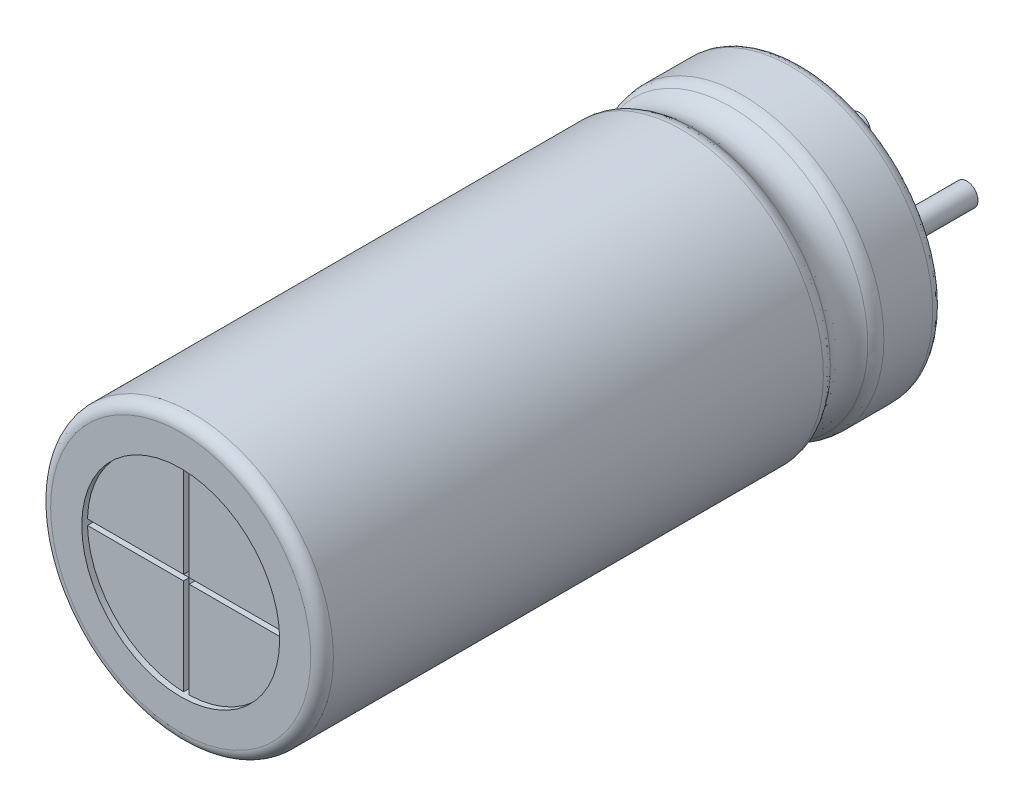
ISO-10303-21;
HEADER;
FILE_DESCRIPTION(('STEP AP214'),'2;1');
FILE_NAME('part.step','',(''),(''),'','','');
FILE_SCHEMA(('AUTOMOTIVE_DESIGN { 1 0 10303 214 1 1 1 1 }'));
ENDSEC;
DATA;
#1=APPLICATION_CONTEXT('core data for automotive mechanical design processes');
#2=APPLICATION_PROTOCOL_DEFINITION('international standard','automotive_design',2000,#1);
#3=PRODUCT_CONTEXT('',#1,'mechanical');
#4=PRODUCT('Part','Part','',(#3));
#5=PRODUCT_RELATED_PRODUCT_CATEGORY('part','',(#4));
#6=PRODUCT_DEFINITION_FORMATION('','',#4);
#7=PRODUCT_DEFINITION_CONTEXT('part definition',#1,'design');
#8=PRODUCT_DEFINITION('design','',#6,#7);
#9=PRODUCT_DEFINITION_SHAPE('','',#8);
#10=(LENGTH_UNIT() NAMED_UNIT(*) SI_UNIT(.MILLI.,.METRE.));
#11=(NAMED_UNIT(*) PLANE_ANGLE_UNIT() SI_UNIT($,.RADIAN.));
#12=(NAMED_UNIT(*) SI_UNIT($,.STERADIAN.) SOLID_ANGLE_UNIT());
#13=UNCERTAINTY_MEASURE_WITH_UNIT(LENGTH_MEASURE(1.E-05),#10,'distance_accuracy_value','');
#14=(GEOMETRIC_REPRESENTATION_CONTEXT(3) GLOBAL_UNCERTAINTY_ASSIGNED_CONTEXT((#13)) GLOBAL_UNIT_ASSIGNED_CONTEXT((#10,
#11,#12)) REPRESENTATION_CONTEXT('',''));
#15=CARTESIAN_POINT('',(0.,0.,0.));
#16=DIRECTION('',(0.,0.,1.));
#17=DIRECTION('',(1.,0.,0.));
#18=AXIS2_PLACEMENT_3D('',#15,#16,#17);
#19=CARTESIAN_POINT('',(2.,0.,-1.9));
#20=DIRECTION('',(0.,0.,1.));
#21=DIRECTION('',(0.,-1.,0.));
#22=AXIS2_PLACEMENT_3D('',#19,#20,#21);
#23=PLANE('',#22);
#24=CARTESIAN_POINT('',(2.,0.,-1.9));
#25=DIRECTION('',(0.,0.,1.));
#26=DIRECTION('',(-1.,0.,0.));
#27=AXIS2_PLACEMENT_3D('',#24,#25,#26);
#28=CIRCLE('',#27,0.2);
#29=CARTESIAN_POINT('',(1.8,0.,-1.9));
#30=VERTEX_POINT('',#29);
#31=EDGE_CURVE('E31',#30,#30,#28,.T.);
#32=ORIENTED_EDGE('',*,*,#31,.F.);
#33=EDGE_LOOP('',(#32));
#34=FACE_BOUND('',#33,.T.);
#35=ADVANCED_FACE('F18',(#34),#23,.F.);
#36=CARTESIAN_POINT('',(2.,0.,0.3));
#37=DIRECTION('',(0.,0.,1.));
#38=DIRECTION('',(-1.,0.,0.));
#39=AXIS2_PLACEMENT_3D('',#36,#37,#38);
#40=CYLINDRICAL_SURFACE('',#39,0.2);
#41=CARTESIAN_POINT('',(2.,0.,0.2));
#42=DIRECTION('',(0.,0.,1.));
#43=DIRECTION('',(-1.,0.,0.));
#44=AXIS2_PLACEMENT_3D('',#41,#42,#43);
#45=CIRCLE('',#44,0.2);
#46=CARTESIAN_POINT('',(1.8,0.,0.2));
#47=VERTEX_POINT('',#46);
#48=EDGE_CURVE('E251',#47,#47,#45,.T.);
#49=ORIENTED_EDGE('',*,*,#48,.F.);
#50=DIRECTION('',(0.,0.,-1.));
#51=VECTOR('',#50,1.);
#52=CARTESIAN_POINT('',(1.8,0.,0.3));
#53=LINE('',#52,#51);
#54=EDGE_CURVE('E11',#47,#30,#53,.T.);
#55=ORIENTED_EDGE('',*,*,#54,.T.);
#56=ORIENTED_EDGE('',*,*,#31,.T.);
#57=ORIENTED_EDGE('',*,*,#54,.F.);
#58=EDGE_LOOP('',(#49,#55,#56,#57));
#59=FACE_BOUND('',#58,.T.);
#60=ADVANCED_FACE('F562',(#59),#40,.T.);
#61=CARTESIAN_POINT('',(1.,0.,0.2));
#62=DIRECTION('',(0.,0.,1.));
#63=DIRECTION('',(1.,0.,0.));
#64=AXIS2_PLACEMENT_3D('',#61,#62,#63);
#65=PLANE('',#64);
#66=CARTESIAN_POINT('',(1.,0.,0.2));
#67=DIRECTION('',(0.,0.,1.));
#68=DIRECTION('',(1.,0.,0.));
#69=AXIS2_PLACEMENT_3D('',#66,#67,#68);
#70=CIRCLE('',#69,1.75);
#71=CARTESIAN_POINT('',(2.75,0.,0.2));
#72=VERTEX_POINT('',#71);
#73=EDGE_CURVE('E240',#72,#72,#70,.T.);
#74=ORIENTED_EDGE('',*,*,#73,.F.);
#75=EDGE_LOOP('',(#74));
#76=FACE_BOUND('',#75,.T.);
#77=ORIENTED_EDGE('',*,*,#48,.T.);
#78=EDGE_LOOP('',(#77));
#79=FACE_BOUND('',#78,.T.);
#80=CARTESIAN_POINT('',(0.,0.,0.2));
#81=DIRECTION('',(0.,0.,1.));
#82=DIRECTION('',(-1.,0.,0.));
#83=AXIS2_PLACEMENT_3D('',#80,#81,#82);
#84=CIRCLE('',#83,0.2);
#85=CARTESIAN_POINT('',(-0.2,0.,0.2));
#86=VERTEX_POINT('',#85);
#87=EDGE_CURVE('E247',#86,#86,#84,.T.);
#88=ORIENTED_EDGE('',*,*,#87,.T.);
#89=EDGE_LOOP('',(#88));
#90=FACE_BOUND('',#89,.T.);
#91=ADVANCED_FACE('F565',(#76,#79,#90),#65,.F.);
#92=CARTESIAN_POINT('',(1.,0.,0.3));
#93=DIRECTION('',(0.,0.,-1.));
#94=DIRECTION('',(1.,0.,0.));
#95=AXIS2_PLACEMENT_3D('',#92,#93,#94);
#96=CYLINDRICAL_SURFACE('',#95,1.75);
#97=DIRECTION('',(0.,0.,-1.));
#98=VECTOR('',#97,1.);
#99=CARTESIAN_POINT('',(2.75,0.,0.3));
#100=LINE('',#99,#98);
#101=CARTESIAN_POINT('',(2.75,0.,0.));
#102=VERTEX_POINT('',#101);
#103=EDGE_CURVE('E252',#72,#102,#100,.T.);
#104=ORIENTED_EDGE('',*,*,#103,.T.);
#105=CARTESIAN_POINT('',(1.,0.,0.));
#106=DIRECTION('',(0.,0.,-1.));
#107=DIRECTION('',(1.,0.,0.));
#108=AXIS2_PLACEMENT_3D('',#105,#106,#107);
#109=CIRCLE('',#108,1.75);
#110=EDGE_CURVE('E262',#102,#102,#109,.T.);
#111=ORIENTED_EDGE('',*,*,#110,.T.);
#112=ORIENTED_EDGE('',*,*,#103,.F.);
#113=ORIENTED_EDGE('',*,*,#73,.T.);
#114=EDGE_LOOP('',(#104,#111,#112,#113));
#115=FACE_BOUND('',#114,.T.);
#116=ADVANCED_FACE('F569',(#115),#96,.F.);
#117=CARTESIAN_POINT('',(0.,0.,0.3));
#118=DIRECTION('',(0.,0.,1.));
#119=DIRECTION('',(-1.,0.,0.));
#120=AXIS2_PLACEMENT_3D('',#117,#118,#119);
#121=CYLINDRICAL_SURFACE('',#120,0.2);
#122=ORIENTED_EDGE('',*,*,#87,.F.);
#123=DIRECTION('',(0.,0.,-1.));
#124=VECTOR('',#123,1.);
#125=CARTESIAN_POINT('',(-0.2,0.,0.3));
#126=LINE('',#125,#124);
#127=CARTESIAN_POINT('',(-0.2,0.,-2.));
#128=VERTEX_POINT('',#127);
#129=EDGE_CURVE('E283',#86,#128,#126,.T.);
#130=ORIENTED_EDGE('',*,*,#129,.T.);
#131=CARTESIAN_POINT('',(0.,0.,-2.));
#132=DIRECTION('',(0.,0.,1.));
#133=DIRECTION('',(-1.,0.,0.));
#134=AXIS2_PLACEMENT_3D('',#131,#132,#133);
#135=CIRCLE('',#134,0.2);
#136=EDGE_CURVE('E287',#128,#128,#135,.T.);
#137=ORIENTED_EDGE('',*,*,#136,.T.);
#138=ORIENTED_EDGE('',*,*,#129,.F.);
#139=EDGE_LOOP('',(#122,#130,#137,#138));
#140=FACE_BOUND('',#139,.T.);
#141=ADVANCED_FACE('F573',(#140),#121,.T.);
#142=CARTESIAN_POINT('',(1.,0.,0.));
#143=DIRECTION('',(0.,0.,-1.));
#144=DIRECTION('',(0.,-1.,0.));
#145=AXIS2_PLACEMENT_3D('',#142,#143,#144);
#146=PLANE('',#145);
#147=ORIENTED_EDGE('',*,*,#110,.F.);
#148=EDGE_LOOP('',(#147));
#149=FACE_BOUND('',#148,.T.);
#150=CARTESIAN_POINT('',(1.,0.,0.));
#151=DIRECTION('',(0.,0.,-1.));
#152=DIRECTION('',(1.,0.,0.));
#153=AXIS2_PLACEMENT_3D('',#150,#151,#152);
#154=CIRCLE('',#153,2.3);
#155=CARTESIAN_POINT('',(3.3,0.,0.));
#156=VERTEX_POINT('',#155);
#157=EDGE_CURVE('E288',#156,#156,#154,.T.);
#158=ORIENTED_EDGE('',*,*,#157,.T.);
#159=EDGE_LOOP('',(#158));
#160=FACE_BOUND('',#159,.T.);
#161=ADVANCED_FACE('F577',(#149,#160),#146,.T.);
#162=CARTESIAN_POINT('',(0.,0.,-2.));
#163=DIRECTION('',(0.,0.,1.));
#164=DIRECTION('',(1.,0.,0.));
#165=AXIS2_PLACEMENT_3D('',#162,#163,#164);
#166=PLANE('',#165);
#167=ORIENTED_EDGE('',*,*,#136,.F.);
#168=EDGE_LOOP('',(#167));
#169=FACE_BOUND('',#168,.T.);
#170=ADVANCED_FACE('F437',(#169),#166,.F.);
#171=CARTESIAN_POINT('',(3.3,0.,0.));
#172=CARTESIAN_POINT('',(3.41715728752538,0.,0.));
#173=CARTESIAN_POINT('',(3.5,0.,0.0828427124746191));
#174=CARTESIAN_POINT('',(3.5,0.,0.2));
#175=(BOUNDED_CURVE() B_SPLINE_CURVE(3,(#171,#172,#173,#174),.UNSPECIFIED.,.F.,
.F.) B_SPLINE_CURVE_WITH_KNOTS((4,4),(0.,1.),
.UNSPECIFIED.) CURVE() GEOMETRIC_REPRESENTATION_ITEM() RATIONAL_B_SPLINE_CURVE((1.,
0.804737854124365,0.804737854124365,1.)) REPRESENTATION_ITEM(''));
#176=CARTESIAN_POINT('',(1.,0.,0.));
#177=DIRECTION('',(0.,0.,1.));
#178=AXIS1_PLACEMENT('',#176,#177);
#179=SURFACE_OF_REVOLUTION('',#175,#178);
#180=CARTESIAN_POINT('',(3.3,0.,0.2));
#181=DIRECTION('',(0.,-1.,0.));
#182=DIRECTION('',(0.,0.,-1.));
#183=AXIS2_PLACEMENT_3D('',#180,#181,#182);
#184=CIRCLE('',#183,0.2);
#185=CARTESIAN_POINT('',(3.5,0.,0.2));
#186=VERTEX_POINT('',#185);
#187=EDGE_CURVE('E257',#156,#186,#184,.T.);
#188=ORIENTED_EDGE('',*,*,#187,.T.);
#189=CARTESIAN_POINT('',(1.,0.,0.2));
#190=DIRECTION('',(0.,0.,-1.));
#191=DIRECTION('',(1.,0.,0.));
#192=AXIS2_PLACEMENT_3D('',#189,#190,#191);
#193=CIRCLE('',#192,2.5);
#194=EDGE_CURVE('E253',#186,#186,#193,.T.);
#195=ORIENTED_EDGE('',*,*,#194,.T.);
#196=ORIENTED_EDGE('',*,*,#187,.F.);
#197=ORIENTED_EDGE('',*,*,#157,.F.);
#198=EDGE_LOOP('',(#188,#195,#196,#197));
#199=FACE_BOUND('',#198,.T.);
#200=ADVANCED_FACE('F433',(#199),#179,.T.);
#201=CARTESIAN_POINT('',(1.,0.,0.2));
#202=DIRECTION('',(0.,0.,1.));
#203=DIRECTION('',(1.,0.,0.));
#204=AXIS2_PLACEMENT_3D('',#201,#202,#203);
#205=CYLINDRICAL_SURFACE('',#204,2.5);
#206=CARTESIAN_POINT('',(3.5,0.,1.064979142851));
#207=CARTESIAN_POINT('',(3.499999999999,1.190825886764,1.064979142851));
#208=CARTESIAN_POINT('',(2.884541892305,2.409113115874,1.064979142851));
#209=CARTESIAN_POINT('',(1.618015285806,3.28024032087,1.064979142851));
#210=CARTESIAN_POINT('',(-0.124886085383,3.414028857892,1.064979142852));
#211=CARTESIAN_POINT('',(-1.630545419379,2.485545151003,1.064979142851));
#212=CARTESIAN_POINT('',(-2.734788378774,1.130166370723,1.064979142852));
#213=CARTESIAN_POINT('',(-2.734788378755,-1.130166370699,1.06497914285));
#214=CARTESIAN_POINT('',(-1.630545419375,-2.485545151045,1.064979142852));
#215=CARTESIAN_POINT('',(-0.124886085402,-3.414028857855,1.064979142851));
#216=CARTESIAN_POINT('',(1.618015285825,-3.280240320887,1.064979142851));
#217=CARTESIAN_POINT('',(2.884541892296,-2.409113115869,1.064979142851));
#218=CARTESIAN_POINT('',(3.500000000001,-1.190825886764,1.064979142851));
#219=CARTESIAN_POINT('',(3.5,0.,1.064979142851));
#220=(BOUNDED_CURVE() B_SPLINE_CURVE(13,(#206,#207,#208,#209,#210,#211,#212,#213,#214,#215,#216,
#217,#218,#219),.UNSPECIFIED.,.T.,.F.) B_SPLINE_CURVE_WITH_KNOTS((14,14),(0.,15.707963267949),
.UNSPECIFIED.) CURVE() GEOMETRIC_REPRESENTATION_ITEM() RATIONAL_B_SPLINE_CURVE((1.,1.,
0.999999999999,1.000000000002,0.999999999995,1.000000000008,0.99999999999,1.000000000011,
0.99999999999,1.000000000006,0.999999999997,1.000000000001,1.,1.)) REPRESENTATION_ITEM(''));
#221=CARTESIAN_POINT('',(3.5,0.,1.064979142851));
#222=VERTEX_POINT('',#221);
#223=EDGE_CURVE('E258',#222,#222,#220,.F.);
#224=ORIENTED_EDGE('',*,*,#223,.T.);
#225=DIRECTION('',(0.,0.,1.));
#226=VECTOR('',#225,1.);
#227=CARTESIAN_POINT('',(3.5,0.,0.2));
#228=LINE('',#227,#226);
#229=EDGE_CURVE('E605',#186,#222,#228,.T.);
#230=ORIENTED_EDGE('',*,*,#229,.F.);
#231=ORIENTED_EDGE('',*,*,#194,.F.);
#232=ORIENTED_EDGE('',*,*,#229,.T.);
#233=EDGE_LOOP('',(#224,#230,#231,#232));
#234=FACE_BOUND('',#233,.T.);
#235=ADVANCED_FACE('F436',(#234),#205,.T.);
#236=CARTESIAN_POINT('',(3.5,0.,1.064979142851));
#237=CARTESIAN_POINT('',(3.500000000001,-1.190825886764,1.064979142851));
#238=CARTESIAN_POINT('',(2.884541892296,-2.409113115869,1.064979142851));
#239=CARTESIAN_POINT('',(1.618015285825,-3.280240320887,1.064979142851));
#240=CARTESIAN_POINT('',(-0.124886085402,-3.414028857855,1.064979142851));
#241=CARTESIAN_POINT('',(-1.630545419375,-2.485545151045,1.064979142852));
#242=CARTESIAN_POINT('',(-2.734788378755,-1.130166370699,1.06497914285));
#243=CARTESIAN_POINT('',(-2.734788378774,1.130166370723,1.064979142852));
#244=CARTESIAN_POINT('',(-1.630545419379,2.485545151003,1.064979142851));
#245=CARTESIAN_POINT('',(-0.124886085383,3.414028857892,1.064979142852));
#246=CARTESIAN_POINT('',(1.618015285806,3.28024032087,1.064979142851));
#247=CARTESIAN_POINT('',(2.884541892305,2.409113115874,1.064979142851));
#248=CARTESIAN_POINT('',(3.499999999999,1.190825886764,1.064979142851));
#249=CARTESIAN_POINT('',(3.5,0.,1.064979142851));
#250=CARTESIAN_POINT('',(3.5,0.,1.182962690499));
#251=CARTESIAN_POINT('',(3.500000000001,-1.190825886764,1.182962690499));
#252=CARTESIAN_POINT('',(2.884541892297,-2.40911311587,1.182962690499));
#253=CARTESIAN_POINT('',(1.618015285824,-3.280240320884,1.182962690499));
#254=CARTESIAN_POINT('',(-0.1248860854,-3.414028857861,1.182962690499));
#255=CARTESIAN_POINT('',(-1.630545419378,-2.485545151035,1.182962690499));
#256=CARTESIAN_POINT('',(-2.73478837875,-1.13016637071,1.182962690499));
#257=CARTESIAN_POINT('',(-2.73478837878,1.130166370735,1.182962690499));
#258=CARTESIAN_POINT('',(-1.630545419374,2.485545150991,1.182962690499));
#259=CARTESIAN_POINT('',(-0.124886085386,3.414028857901,1.182962690499));
#260=CARTESIAN_POINT('',(1.618015285807,3.280240320865,1.182962690499));
#261=CARTESIAN_POINT('',(2.884541892305,2.409113115875,1.182962690499));
#262=CARTESIAN_POINT('',(3.499999999999,1.190825886764,1.182962690499));
#263=CARTESIAN_POINT('',(3.5,0.,1.182962690499));
#264=CARTESIAN_POINT('',(3.419629897377,0.,1.269338405373));
#265=CARTESIAN_POINT('',(3.419629897378,-1.152543167274,1.269338405373));
#266=CARTESIAN_POINT('',(2.823957562183,-2.331664848528,1.269338405373));
#267=CARTESIAN_POINT('',(1.598147305047,-3.174787020397,1.269338405373));
#268=CARTESIAN_POINT('',(-0.08872320135259,-3.304274517993,1.269338405373));
#269=CARTESIAN_POINT('',(-1.545978537251,-2.405639743493,1.269338405373));
#270=CARTESIAN_POINT('',(-2.614722248644,-1.093833735828,1.269338405373));
#271=CARTESIAN_POINT('',(-2.614722248662,1.093833735852,1.269338405373));
#272=CARTESIAN_POINT('',(-1.545978537255,2.405639743452,1.269338405373));
#273=CARTESIAN_POINT('',(-0.08872320133354,3.304274518029,1.269338405373));
#274=CARTESIAN_POINT('',(1.598147305028,3.17478702038,1.269338405373));
#275=CARTESIAN_POINT('',(2.823957562192,2.331664848533,1.269338405373));
#276=CARTESIAN_POINT('',(3.419629897376,1.152543167273,1.269338405373));
#277=CARTESIAN_POINT('',(3.419629897377,0.,1.269338405373));
#278=(BOUNDED_SURFACE() B_SPLINE_SURFACE(2,13,((#236,#237,#238,#239,#240,#241,#242,#243,#244,
#245,#246,#247,#248,#249),(#250,#251,#252,#253,#254,#255,#256,#257,#258,#259,#260,#261,#262,
#263),(#264,#265,#266,#267,#268,#269,#270,#271,#272,#273,#274,#275,#276,#277)),.UNSPECIFIED.,
.F.,.T.,.F.) B_SPLINE_SURFACE_WITH_KNOTS((3,3),(14,14),(0.,15.707963267949),(0.,
15.707963267949),.UNSPECIFIED.) GEOMETRIC_REPRESENTATION_ITEM() RATIONAL_B_SPLINE_SURFACE(((1.,
1.,1.000000000001,0.999999999997,1.000000000006,0.99999999999,1.000000000011,0.99999999999,
1.000000000008,0.999999999995,1.000000000002,0.999999999999,1.,1.),(0.93061798229,
0.930617982289,0.930617982291,0.930617982287,0.930617982296,0.930617982281,0.9306179823,
0.93061798228,0.930617982297,0.930617982285,0.930617982292,0.930617982289,0.93061798229,
0.93061798229),(1.,1.,1.000000000001,0.999999999997,1.000000000006,0.99999999999,1.000000000011,
0.99999999999,1.000000000008,0.999999999995,1.000000000002,0.999999999999,1.,1.))) REPRESENTATION_ITEM('') SURFACE());
#279=CARTESIAN_POINT('',(3.5,0.,1.064979142851));
#280=CARTESIAN_POINT('',(3.5,0.,1.182962690499));
#281=CARTESIAN_POINT('',(3.419629897377,0.,1.269338405373));
#282=(BOUNDED_CURVE() B_SPLINE_CURVE(2,(#279,#280,#281),.UNSPECIFIED.,.F.,
.F.) B_SPLINE_CURVE_WITH_KNOTS((3,3),(0.,15.707963267949),
.UNSPECIFIED.) CURVE() GEOMETRIC_REPRESENTATION_ITEM() RATIONAL_B_SPLINE_CURVE((1.,
0.93061798229,1.)) REPRESENTATION_ITEM(''));
#283=CARTESIAN_POINT('',(3.419629897377,0.,1.269338405373));
#284=VERTEX_POINT('',#283);
#285=EDGE_CURVE('E613',#222,#284,#282,.T.);
#286=CARTESIAN_POINT('',(3.41962989737711,0.,1.26933840537289));
#287=CARTESIAN_POINT('',(3.41962989737811,-1.15254316727405,1.26933840537289));
#288=CARTESIAN_POINT('',(2.82395756218308,-2.3316648485281,1.26933840537289));
#289=CARTESIAN_POINT('',(1.59814730504703,-3.17478702039714,1.26933840537289));
#290=CARTESIAN_POINT('',(-0.088723201352638,-3.30427451799315,1.26933840537289));
#291=CARTESIAN_POINT('',(-1.54597853725111,-2.40563974349311,1.26933840537288));
#292=CARTESIAN_POINT('',(-2.61472224864416,-1.09383373582805,1.26933840537288));
#293=CARTESIAN_POINT('',(-2.61472224866216,1.09383373585205,1.26933840537288));
#294=CARTESIAN_POINT('',(-1.54597853725511,2.40563974345211,1.26933840537288));
#295=CARTESIAN_POINT('',(-0.088723201333588,3.30427451802915,1.26933840537288));
#296=CARTESIAN_POINT('',(1.59814730502803,3.17478702038014,1.26933840537289));
#297=CARTESIAN_POINT('',(2.82395756219208,2.33166484853311,1.26933840537288));
#298=CARTESIAN_POINT('',(3.41962989737611,1.15254316727305,1.26933840537289));
#299=CARTESIAN_POINT('',(3.41962989737711,0.,1.26933840537289));
#300=(BOUNDED_CURVE() B_SPLINE_CURVE(13,(#286,#287,#288,#289,#290,#291,#292,#293,#294,#295,#296,
#297,#298,#299),.UNSPECIFIED.,.T.,.F.) B_SPLINE_CURVE_WITH_KNOTS((14,14),(0.,15.707963267949),
.UNSPECIFIED.) CURVE() GEOMETRIC_REPRESENTATION_ITEM() RATIONAL_B_SPLINE_CURVE((0.999999999999901,
0.999999999999901,1.0000000000009,0.999999999996901,1.0000000000059,0.999999999989901,
1.0000000000109,0.999999999989901,1.0000000000079,0.999999999994901,1.0000000000019,
0.999999999998901,0.999999999999901,0.999999999999901)) REPRESENTATION_ITEM(''));
#301=EDGE_CURVE('E618',#284,#284,#300,.T.);
#302=ORIENTED_EDGE('',*,*,#285,.T.);
#303=ORIENTED_EDGE('',*,*,#301,.T.);
#304=ORIENTED_EDGE('',*,*,#285,.F.);
#305=ORIENTED_EDGE('',*,*,#223,.F.);
#306=EDGE_LOOP('',(#302,#303,#304,#305));
#307=FACE_BOUND('',#306,.T.);
#308=ADVANCED_FACE('F514',(#307),#278,.T.);
#309=CARTESIAN_POINT('',(3.42262261853665,0.,1.26615096071228));
#310=CARTESIAN_POINT('',(3.23532926410463,0.,1.46383893950967));
#311=CARTESIAN_POINT('',(3.23532926410463,0.,1.73616106049032));
#312=CARTESIAN_POINT('',(3.42262261853665,0.,1.93384903928772));
#313=(BOUNDED_CURVE() B_SPLINE_CURVE(3,(#309,#310,#311,#312),.UNSPECIFIED.,.F.,
.F.) B_SPLINE_CURVE_WITH_KNOTS((4,4),(0.,1.),
.UNSPECIFIED.) CURVE() GEOMETRIC_REPRESENTATION_ITEM() RATIONAL_B_SPLINE_CURVE((1.,
0.817289559108677,0.817289559108677,1.)) REPRESENTATION_ITEM(''));
#314=CARTESIAN_POINT('',(1.,0.,0.));
#315=DIRECTION('',(0.,0.,1.));
#316=AXIS1_PLACEMENT('',#314,#315);
#317=SURFACE_OF_REVOLUTION('',#313,#316);
#318=CARTESIAN_POINT('',(1.,0.,1.93066159462752));
#319=DIRECTION('',(0.,0.,-1.));
#320=DIRECTION('',(1.,0.,0.));
#321=AXIS2_PLACEMENT_3D('',#318,#319,#320);
#322=CIRCLE('',#321,2.41962989737643);
#323=CARTESIAN_POINT('',(3.419629897377,0.,1.930661594627));
#324=VERTEX_POINT('',#323);
#325=EDGE_CURVE('E650',#324,#324,#322,.T.);
#326=ORIENTED_EDGE('',*,*,#325,.T.);
#327=CARTESIAN_POINT('',(3.775,0.,1.6));
#328=DIRECTION('',(0.,1.,0.));
#329=DIRECTION('',(-0.566528822887193,0.,-0.82404192419928));
#330=AXIS2_PLACEMENT_3D('',#327,#328,#329);
#331=CIRCLE('',#330,0.485412195974);
#332=EDGE_CURVE('E642',#284,#324,#331,.T.);
#333=ORIENTED_EDGE('',*,*,#332,.F.);
#334=ORIENTED_EDGE('',*,*,#301,.F.);
#335=ORIENTED_EDGE('',*,*,#332,.T.);
#336=EDGE_LOOP('',(#326,#333,#334,#335));
#337=FACE_BOUND('',#336,.T.);
#338=ADVANCED_FACE('F20',(#337),#317,.T.);
#339=CARTESIAN_POINT('',(3.419629897377,0.,1.930661594627));
#340=CARTESIAN_POINT('',(3.419629897378,-1.152543167274,1.930661594627));
#341=CARTESIAN_POINT('',(2.823957562183,-2.331664848528,1.930661594627));
#342=CARTESIAN_POINT('',(1.598147305047,-3.174787020397,1.930661594627));
#343=CARTESIAN_POINT('',(-0.0887232013526299,-3.304274517993,1.930661594627));
#344=CARTESIAN_POINT('',(-1.545978537251,-2.405639743492,1.930661594627));
#345=CARTESIAN_POINT('',(-2.614722248643,-1.093833735829,1.930661594627));
#346=CARTESIAN_POINT('',(-2.614722248663,1.093833735853,1.930661594627));
#347=CARTESIAN_POINT('',(-1.545978537254,2.405639743451,1.930661594627));
#348=CARTESIAN_POINT('',(-0.0887232013347,3.30427451803,1.930661594627));
#349=CARTESIAN_POINT('',(1.598147305029,3.17478702038,1.930661594627));
#350=CARTESIAN_POINT('',(2.823957562192,2.331664848533,1.930661594627));
#351=CARTESIAN_POINT('',(3.419629897376,1.152543167273,1.930661594627));
#352=CARTESIAN_POINT('',(3.419629897377,0.,1.930661594627));
#353=CARTESIAN_POINT('',(3.5,0.,2.017037309501));
#354=CARTESIAN_POINT('',(3.500000000001,-1.190825886764,2.017037309501));
#355=CARTESIAN_POINT('',(2.884541892296,-2.40911311587,2.017037309501));
#356=CARTESIAN_POINT('',(1.618015285824,-3.280240320885,2.017037309501));
#357=CARTESIAN_POINT('',(-0.124886085397,-3.414028857858,2.017037309501));
#358=CARTESIAN_POINT('',(-1.630545419388,-2.485545151038,2.0170373095));
#359=CARTESIAN_POINT('',(-2.734788378733,-1.130166370711,2.017037309501));
#360=CARTESIAN_POINT('',(-2.734788378798,1.130166370745,2.0170373095));
#361=CARTESIAN_POINT('',(-1.630545419362,2.485545150978,2.017037309501));
#362=CARTESIAN_POINT('',(-0.124886085391,3.414028857911,2.017037309501));
#363=CARTESIAN_POINT('',(1.618015285808,3.28024032086,2.017037309501));
#364=CARTESIAN_POINT('',(2.884541892305,2.409113115877,2.017037309501));
#365=CARTESIAN_POINT('',(3.499999999999,1.190825886763,2.017037309501));
#366=CARTESIAN_POINT('',(3.5,0.,2.017037309501));
#367=CARTESIAN_POINT('',(3.5,0.,2.135020857149));
#368=CARTESIAN_POINT('',(3.500000000002,-1.190825886764,2.135020857149));
#369=CARTESIAN_POINT('',(2.884541892295,-2.409113115869,2.135020857149));
#370=CARTESIAN_POINT('',(1.618015285826,-3.280240320886,2.135020857149));
#371=CARTESIAN_POINT('',(-0.124886085405,-3.414028857857,2.135020857149));
#372=CARTESIAN_POINT('',(-1.630545419372,-2.485545151043,2.135020857149));
#373=CARTESIAN_POINT('',(-2.734788378759,-1.130166370701,2.135020857149));
#374=CARTESIAN_POINT('',(-2.73478837877,1.130166370726,2.135020857149));
#375=CARTESIAN_POINT('',(-1.630545419382,2.485545151,2.135020857149));
#376=CARTESIAN_POINT('',(-0.124886085381,3.414028857894,2.135020857149));
#377=CARTESIAN_POINT('',(1.618015285805,3.280240320869,2.135020857149));
#378=CARTESIAN_POINT('',(2.884541892306,2.409113115874,2.135020857149));
#379=CARTESIAN_POINT('',(3.499999999999,1.190825886764,2.135020857149));
#380=CARTESIAN_POINT('',(3.5,0.,2.135020857149));
#381=(BOUNDED_SURFACE() B_SPLINE_SURFACE(2,13,((#339,#340,#341,#342,#343,#344,#345,#346,#347,
#348,#349,#350,#351,#352),(#353,#354,#355,#356,#357,#358,#359,#360,#361,#362,#363,#364,#365,
#366),(#367,#368,#369,#370,#371,#372,#373,#374,#375,#376,#377,#378,#379,#380)),.UNSPECIFIED.,
.F.,.T.,.F.) B_SPLINE_SURFACE_WITH_KNOTS((3,3),(14,14),(0.,15.707963267949),(0.,
15.707963267949),.UNSPECIFIED.) GEOMETRIC_REPRESENTATION_ITEM() RATIONAL_B_SPLINE_SURFACE(((1.,
1.,1.000000000001,0.999999999997,1.000000000006,0.99999999999,1.000000000011,0.99999999999,
1.000000000008,0.999999999995,1.000000000002,0.999999999999,1.,1.),(0.93061798229,
0.930617982289,0.930617982291,0.930617982286,0.930617982297,0.930617982278,0.930617982304,
0.930617982276,0.9306179823,0.930617982283,0.930617982293,0.930617982288,0.93061798229,
0.93061798229),(1.,1.,1.000000000001,0.999999999997,1.000000000006,0.99999999999,1.000000000011,
0.99999999999,1.000000000008,0.999999999995,1.000000000002,0.999999999999,1.,1.))) REPRESENTATION_ITEM('') SURFACE());
#382=CARTESIAN_POINT('',(3.419629897377,0.,1.930661594627));
#383=CARTESIAN_POINT('',(3.5,0.,2.017037309501));
#384=CARTESIAN_POINT('',(3.5,0.,2.135020857149));
#385=(BOUNDED_CURVE() B_SPLINE_CURVE(2,(#382,#383,#384),.UNSPECIFIED.,.F.,
.F.) B_SPLINE_CURVE_WITH_KNOTS((3,3),(0.,15.707963267949),
.UNSPECIFIED.) CURVE() GEOMETRIC_REPRESENTATION_ITEM() RATIONAL_B_SPLINE_CURVE((1.,
0.93061798229,1.)) REPRESENTATION_ITEM(''));
#386=CARTESIAN_POINT('',(3.5,0.,2.135020857149));
#387=VERTEX_POINT('',#386);
#388=EDGE_CURVE('E651',#324,#387,#385,.T.);
#389=CARTESIAN_POINT('',(3.5,0.,2.135020857149));
#390=CARTESIAN_POINT('',(3.500000000002,-1.190825886764,2.135020857149));
#391=CARTESIAN_POINT('',(2.884541892295,-2.409113115869,2.135020857149));
#392=CARTESIAN_POINT('',(1.618015285826,-3.280240320886,2.135020857149));
#393=CARTESIAN_POINT('',(-0.124886085405,-3.414028857857,2.135020857149));
#394=CARTESIAN_POINT('',(-1.630545419372,-2.485545151043,2.135020857149));
#395=CARTESIAN_POINT('',(-2.734788378759,-1.130166370701,2.135020857149));
#396=CARTESIAN_POINT('',(-2.73478837877,1.130166370726,2.135020857149));
#397=CARTESIAN_POINT('',(-1.630545419382,2.485545151,2.135020857149));
#398=CARTESIAN_POINT('',(-0.124886085381,3.414028857894,2.135020857149));
#399=CARTESIAN_POINT('',(1.618015285805,3.280240320869,2.135020857149));
#400=CARTESIAN_POINT('',(2.884541892306,2.409113115874,2.135020857149));
#401=CARTESIAN_POINT('',(3.499999999999,1.190825886764,2.135020857149));
#402=CARTESIAN_POINT('',(3.5,0.,2.135020857149));
#403=(BOUNDED_CURVE() B_SPLINE_CURVE(13,(#389,#390,#391,#392,#393,#394,#395,#396,#397,#398,#399,
#400,#401,#402),.UNSPECIFIED.,.T.,.F.) B_SPLINE_CURVE_WITH_KNOTS((14,14),(0.,15.707963267949),
.UNSPECIFIED.) CURVE() GEOMETRIC_REPRESENTATION_ITEM() RATIONAL_B_SPLINE_CURVE((1.,1.,
1.000000000001,0.999999999997,1.000000000006,0.99999999999,1.000000000011,0.99999999999,
1.000000000008,0.999999999995,1.000000000002,0.999999999999,1.,1.)) REPRESENTATION_ITEM(''));
#404=EDGE_CURVE('E267',#387,#387,#403,.T.);
#405=ORIENTED_EDGE('',*,*,#388,.T.);
#406=ORIENTED_EDGE('',*,*,#404,.T.);
#407=ORIENTED_EDGE('',*,*,#388,.F.);
#408=ORIENTED_EDGE('',*,*,#325,.F.);
#409=EDGE_LOOP('',(#405,#406,#407,#408));
#410=FACE_BOUND('',#409,.T.);
#411=ADVANCED_FACE('F506',(#410),#381,.T.);
#412=CARTESIAN_POINT('',(1.,0.,2.));
#413=DIRECTION('',(0.,0.,1.));
#414=DIRECTION('',(1.,0.,0.));
#415=AXIS2_PLACEMENT_3D('',#412,#413,#414);
#416=CYLINDRICAL_SURFACE('',#415,2.5);
#417=CARTESIAN_POINT('',(1.,0.,10.8));
#418=DIRECTION('',(0.,0.,-1.));
#419=DIRECTION('',(1.,0.,0.));
#420=AXIS2_PLACEMENT_3D('',#417,#418,#419);
#421=CIRCLE('',#420,2.5);
#422=CARTESIAN_POINT('',(3.5,0.,10.8));
#423=VERTEX_POINT('',#422);
#424=EDGE_CURVE('E263',#423,#423,#421,.T.);
#425=ORIENTED_EDGE('',*,*,#424,.T.);
#426=DIRECTION('',(0.,0.,1.));
#427=VECTOR('',#426,1.);
#428=CARTESIAN_POINT('',(3.5,0.,2.));
#429=LINE('',#428,#427);
#430=EDGE_CURVE('E268',#387,#423,#429,.T.);
#431=ORIENTED_EDGE('',*,*,#430,.F.);
#432=ORIENTED_EDGE('',*,*,#404,.F.);
#433=ORIENTED_EDGE('',*,*,#430,.T.);
#434=EDGE_LOOP('',(#425,#431,#432,#433));
#435=FACE_BOUND('',#434,.T.);
#436=ADVANCED_FACE('F512',(#435),#416,.T.);
#437=CARTESIAN_POINT('',(1.,0.,10.8));
#438=DIRECTION('',(0.,0.,1.));
#439=DIRECTION('',(1.,0.,0.));
#440=AXIS2_PLACEMENT_3D('',#437,#438,#439);
#441=TOROIDAL_SURFACE('',#440,2.3,0.2);
#442=CARTESIAN_POINT('',(3.3,0.,10.8));
#443=DIRECTION('',(0.,-1.,0.));
#444=DIRECTION('',(1.,0.,0.));
#445=AXIS2_PLACEMENT_3D('',#442,#443,#444);
#446=CIRCLE('',#445,0.2);
#447=CARTESIAN_POINT('',(3.3,0.,11.));
#448=VERTEX_POINT('',#447);
#449=EDGE_CURVE('E245',#423,#448,#446,.T.);
#450=ORIENTED_EDGE('',*,*,#449,.T.);
#451=CARTESIAN_POINT('',(1.,0.,11.));
#452=DIRECTION('',(0.,0.,-1.));
#453=DIRECTION('',(1.,0.,0.));
#454=AXIS2_PLACEMENT_3D('',#451,#452,#453);
#455=CIRCLE('',#454,2.3);
#456=EDGE_CURVE('E242',#448,#448,#455,.T.);
#457=ORIENTED_EDGE('',*,*,#456,.T.);
#458=ORIENTED_EDGE('',*,*,#449,.F.);
#459=ORIENTED_EDGE('',*,*,#424,.F.);
#460=EDGE_LOOP('',(#450,#457,#458,#459));
#461=FACE_BOUND('',#460,.T.);
#462=ADVANCED_FACE('F504',(#461),#441,.T.);
#463=CARTESIAN_POINT('',(1.,0.,11.));
#464=DIRECTION('',(0.,0.,-1.));
#465=DIRECTION('',(0.,-1.,0.));
#466=AXIS2_PLACEMENT_3D('',#463,#464,#465);
#467=PLANE('',#466);
#468=ORIENTED_EDGE('',*,*,#456,.F.);
#469=EDGE_LOOP('',(#468));
#470=FACE_BOUND('',#469,.T.);
#471=CARTESIAN_POINT('',(1.,0.,11.));
#472=DIRECTION('',(0.,0.,-1.));
#473=DIRECTION('',(1.,0.,0.));
#474=AXIS2_PLACEMENT_3D('',#471,#472,#473);
#475=CIRCLE('',#474,1.75);
#476=CARTESIAN_POINT('',(2.75,0.,11.));
#477=VERTEX_POINT('',#476);
#478=EDGE_CURVE('E246',#477,#477,#475,.T.);
#479=ORIENTED_EDGE('',*,*,#478,.T.);
#480=EDGE_LOOP('',(#479));
#481=FACE_BOUND('',#480,.T.);
#482=ADVANCED_FACE('F500',(#470,#481),#467,.F.);
#483=CARTESIAN_POINT('',(1.,0.,11.));
#484=DIRECTION('',(0.,0.,-1.));
#485=DIRECTION('',(1.,0.,0.));
#486=AXIS2_PLACEMENT_3D('',#483,#484,#485);
#487=CYLINDRICAL_SURFACE('',#486,1.75);
#488=CARTESIAN_POINT('',(1.,0.,10.8));
#489=DIRECTION('',(0.,0.,-1.));
#490=DIRECTION('',(-1.,0.,0.));
#491=AXIS2_PLACEMENT_3D('',#488,#489,#490);
#492=CIRCLE('',#491,1.75);
#493=CARTESIAN_POINT('',(2.75,0.,10.8));
#494=VERTEX_POINT('',#493);
#495=CARTESIAN_POINT('',(2.749285568454,-0.05,10.8));
#496=VERTEX_POINT('',#495);
#497=EDGE_CURVE('E278',#494,#496,#492,.T.);
#498=ORIENTED_EDGE('',*,*,#497,.T.);
#499=DIRECTION('',(0.,0.,-1.));
#500=VECTOR('',#499,1.);
#501=CARTESIAN_POINT('',(2.749285568454,-0.05,10.7));
#502=LINE('',#501,#500);
#503=CARTESIAN_POINT('',(2.749285568454,-0.04999999999996,10.9));
#504=VERTEX_POINT('',#503);
#505=EDGE_CURVE('E318',#504,#496,#502,.T.);
#506=ORIENTED_EDGE('',*,*,#505,.F.);
#507=CARTESIAN_POINT('',(1.,0.,10.9));
#508=DIRECTION('',(0.,0.,1.));
#509=DIRECTION('',(-1.,0.,0.));
#510=AXIS2_PLACEMENT_3D('',#507,#508,#509);
#511=CIRCLE('',#510,1.75);
#512=CARTESIAN_POINT('',(1.05,-1.749285568454,10.9));
#513=VERTEX_POINT('',#512);
#514=EDGE_CURVE('E323',#513,#504,#511,.T.);
#515=ORIENTED_EDGE('',*,*,#514,.F.);
#516=DIRECTION('',(0.,0.,-1.));
#517=VECTOR('',#516,1.);
#518=CARTESIAN_POINT('',(1.05,-1.749285568454,10.7));
#519=LINE('',#518,#517);
#520=CARTESIAN_POINT('',(1.05,-1.749285568454,10.8));
#521=VERTEX_POINT('',#520);
#522=EDGE_CURVE('E282',#513,#521,#519,.T.);
#523=ORIENTED_EDGE('',*,*,#522,.T.);
#524=CARTESIAN_POINT('',(1.,0.,10.8));
#525=DIRECTION('',(0.,0.,-1.));
#526=DIRECTION('',(-1.,0.,0.));
#527=AXIS2_PLACEMENT_3D('',#524,#525,#526);
#528=CIRCLE('',#527,1.75);
#529=CARTESIAN_POINT('',(0.95,-1.749285568454,10.8));
#530=VERTEX_POINT('',#529);
#531=EDGE_CURVE('E330',#521,#530,#528,.T.);
#532=ORIENTED_EDGE('',*,*,#531,.T.);
#533=DIRECTION('',(0.,0.,-1.));
#534=VECTOR('',#533,1.);
#535=CARTESIAN_POINT('',(0.95,-1.749285568454,10.7));
#536=LINE('',#535,#534);
#537=CARTESIAN_POINT('',(0.95,-1.749285568454,10.9));
#538=VERTEX_POINT('',#537);
#539=EDGE_CURVE('E339',#538,#530,#536,.T.);
#540=ORIENTED_EDGE('',*,*,#539,.F.);
#541=CARTESIAN_POINT('',(1.,0.,10.9));
#542=DIRECTION('',(0.,0.,1.));
#543=DIRECTION('',(-1.,0.,0.));
#544=AXIS2_PLACEMENT_3D('',#541,#542,#543);
#545=CIRCLE('',#544,1.75);
#546=CARTESIAN_POINT('',(-0.749285568454,-0.05000000000002,10.9));
#547=VERTEX_POINT('',#546);
#548=EDGE_CURVE('E344',#547,#538,#545,.T.);
#549=ORIENTED_EDGE('',*,*,#548,.F.);
#550=DIRECTION('',(0.,0.,-1.));
#551=VECTOR('',#550,1.);
#552=CARTESIAN_POINT('',(-0.749285568454,-0.05,10.7));
#553=LINE('',#552,#551);
#554=CARTESIAN_POINT('',(-0.749285568454,-0.05,10.8));
#555=VERTEX_POINT('',#554);
#556=EDGE_CURVE('E295',#547,#555,#553,.T.);
#557=ORIENTED_EDGE('',*,*,#556,.T.);
#558=CARTESIAN_POINT('',(1.,0.,10.8));
#559=DIRECTION('',(0.,0.,-1.));
#560=DIRECTION('',(-1.,0.,0.));
#561=AXIS2_PLACEMENT_3D('',#558,#559,#560);
#562=CIRCLE('',#561,1.75);
#563=CARTESIAN_POINT('',(-0.75,0.,10.8));
#564=VERTEX_POINT('',#563);
#565=EDGE_CURVE('E292',#555,#564,#562,.T.);
#566=ORIENTED_EDGE('',*,*,#565,.T.);
#567=CARTESIAN_POINT('',(1.,0.,10.8));
#568=DIRECTION('',(0.,0.,-1.));
#569=DIRECTION('',(-1.,0.,0.));
#570=AXIS2_PLACEMENT_3D('',#567,#568,#569);
#571=CIRCLE('',#570,1.75);
#572=CARTESIAN_POINT('',(-0.749285568454,0.05,10.8));
#573=VERTEX_POINT('',#572);
#574=EDGE_CURVE('E296',#564,#573,#571,.T.);
#575=ORIENTED_EDGE('',*,*,#574,.T.);
#576=DIRECTION('',(0.,0.,-1.));
#577=VECTOR('',#576,1.);
#578=CARTESIAN_POINT('',(-0.749285568454,0.05,10.7));
#579=LINE('',#578,#577);
#580=CARTESIAN_POINT('',(-0.749285568454,0.05000000000002,10.9));
#581=VERTEX_POINT('',#580);
#582=EDGE_CURVE('E304',#581,#573,#579,.T.);
#583=ORIENTED_EDGE('',*,*,#582,.F.);
#584=CARTESIAN_POINT('',(1.,0.,10.9));
#585=DIRECTION('',(0.,0.,1.));
#586=DIRECTION('',(-1.,0.,0.));
#587=AXIS2_PLACEMENT_3D('',#584,#585,#586);
#588=CIRCLE('',#587,1.75);
#589=CARTESIAN_POINT('',(0.95,1.749285568454,10.9));
#590=VERTEX_POINT('',#589);
#591=EDGE_CURVE('E305',#590,#581,#588,.T.);
#592=ORIENTED_EDGE('',*,*,#591,.F.);
#593=DIRECTION('',(0.,0.,-1.));
#594=VECTOR('',#593,1.);
#595=CARTESIAN_POINT('',(0.95,1.749285568454,10.7));
#596=LINE('',#595,#594);
#597=CARTESIAN_POINT('',(0.95,1.749285568454,10.8));
#598=VERTEX_POINT('',#597);
#599=EDGE_CURVE('E356',#590,#598,#596,.T.);
#600=ORIENTED_EDGE('',*,*,#599,.T.);
#601=CARTESIAN_POINT('',(1.,0.,10.8));
#602=DIRECTION('',(0.,0.,-1.));
#603=DIRECTION('',(-1.,0.,0.));
#604=AXIS2_PLACEMENT_3D('',#601,#602,#603);
#605=CIRCLE('',#604,1.75);
#606=CARTESIAN_POINT('',(1.05,1.749285568454,10.8));
#607=VERTEX_POINT('',#606);
#608=EDGE_CURVE('E369',#598,#607,#605,.T.);
#609=ORIENTED_EDGE('',*,*,#608,.T.);
#610=DIRECTION('',(0.,0.,-1.));
#611=VECTOR('',#610,1.);
#612=CARTESIAN_POINT('',(1.05,1.749285568454,10.7));
#613=LINE('',#612,#611);
#614=CARTESIAN_POINT('',(1.05,1.749285568454,10.9));
#615=VERTEX_POINT('',#614);
#616=EDGE_CURVE('E311',#615,#607,#613,.T.);
#617=ORIENTED_EDGE('',*,*,#616,.F.);
#618=CARTESIAN_POINT('',(1.,0.,10.9));
#619=DIRECTION('',(0.,0.,1.));
#620=DIRECTION('',(-1.,0.,0.));
#621=AXIS2_PLACEMENT_3D('',#618,#619,#620);
#622=CIRCLE('',#621,1.75);
#623=CARTESIAN_POINT('',(2.749285568454,0.04999999999996,10.9));
#624=VERTEX_POINT('',#623);
#625=EDGE_CURVE('E363',#624,#615,#622,.T.);
#626=ORIENTED_EDGE('',*,*,#625,.F.);
#627=DIRECTION('',(0.,0.,-1.));
#628=VECTOR('',#627,1.);
#629=CARTESIAN_POINT('',(2.749285568454,0.05,10.7));
#630=LINE('',#629,#628);
#631=CARTESIAN_POINT('',(2.749285568454,0.05,10.8));
#632=VERTEX_POINT('',#631);
#633=EDGE_CURVE('E373',#624,#632,#630,.T.);
#634=ORIENTED_EDGE('',*,*,#633,.T.);
#635=CARTESIAN_POINT('',(1.,0.,10.8));
#636=DIRECTION('',(0.,0.,-1.));
#637=DIRECTION('',(-1.,0.,0.));
#638=AXIS2_PLACEMENT_3D('',#635,#636,#637);
#639=CIRCLE('',#638,1.75);
#640=EDGE_CURVE('E382',#632,#494,#639,.T.);
#641=ORIENTED_EDGE('',*,*,#640,.T.);
#642=DIRECTION('',(0.,0.,-1.));
#643=VECTOR('',#642,1.);
#644=CARTESIAN_POINT('',(2.75,0.,11.));
#645=LINE('',#644,#643);
#646=EDGE_CURVE('E385',#477,#494,#645,.T.);
#647=ORIENTED_EDGE('',*,*,#646,.F.);
#648=ORIENTED_EDGE('',*,*,#478,.F.);
#649=ORIENTED_EDGE('',*,*,#646,.T.);
#650=EDGE_LOOP('',(#498,#506,#515,#523,#532,#540,#549,#557,#566,#575,#583,#592,#600,#609,#617,
#626,#634,#641,#647,#648,#649));
#651=FACE_BOUND('',#650,.T.);
#652=ADVANCED_FACE('F496',(#651),#487,.F.);
#653=CARTESIAN_POINT('',(1.,0.,10.8));
#654=DIRECTION('',(0.,0.,1.));
#655=DIRECTION('',(1.,0.,0.));
#656=AXIS2_PLACEMENT_3D('',#653,#654,#655);
#657=PLANE('',#656);
#658=DIRECTION('',(1.,0.,0.));
#659=VECTOR('',#658,1.);
#660=CARTESIAN_POINT('',(-4.05,-0.05,10.8));
#661=LINE('',#660,#659);
#662=CARTESIAN_POINT('',(0.95,-0.05,10.8));
#663=VERTEX_POINT('',#662);
#664=EDGE_CURVE('E390',#555,#663,#661,.T.);
#665=ORIENTED_EDGE('',*,*,#664,.T.);
#666=DIRECTION('',(0.,-1.,0.));
#667=VECTOR('',#666,1.);
#668=CARTESIAN_POINT('',(0.95,-0.05,10.8));
#669=LINE('',#668,#667);
#670=EDGE_CURVE('E386',#663,#530,#669,.T.);
#671=ORIENTED_EDGE('',*,*,#670,.T.);
#672=ORIENTED_EDGE('',*,*,#531,.F.);
#673=DIRECTION('',(0.,1.,0.));
#674=VECTOR('',#673,1.);
#675=CARTESIAN_POINT('',(1.05,-5.05,10.8));
#676=LINE('',#675,#674);
#677=CARTESIAN_POINT('',(1.05,-0.05,10.8));
#678=VERTEX_POINT('',#677);
#679=EDGE_CURVE('E391',#521,#678,#676,.T.);
#680=ORIENTED_EDGE('',*,*,#679,.T.);
#681=DIRECTION('',(1.,0.,0.));
#682=VECTOR('',#681,1.);
#683=CARTESIAN_POINT('',(1.05,-0.05,10.8));
#684=LINE('',#683,#682);
#685=EDGE_CURVE('E276',#678,#496,#684,.T.);
#686=ORIENTED_EDGE('',*,*,#685,.T.);
#687=ORIENTED_EDGE('',*,*,#497,.F.);
#688=ORIENTED_EDGE('',*,*,#640,.F.);
#689=DIRECTION('',(-1.,0.,0.));
#690=VECTOR('',#689,1.);
#691=CARTESIAN_POINT('',(6.05,0.05,10.8));
#692=LINE('',#691,#690);
#693=CARTESIAN_POINT('',(1.05,0.05,10.8));
#694=VERTEX_POINT('',#693);
#695=EDGE_CURVE('E272',#632,#694,#692,.T.);
#696=ORIENTED_EDGE('',*,*,#695,.T.);
#697=DIRECTION('',(0.,1.,0.));
#698=VECTOR('',#697,1.);
#699=CARTESIAN_POINT('',(1.05,0.05,10.8));
#700=LINE('',#699,#698);
#701=EDGE_CURVE('E277',#694,#607,#700,.T.);
#702=ORIENTED_EDGE('',*,*,#701,.T.);
#703=ORIENTED_EDGE('',*,*,#608,.F.);
#704=DIRECTION('',(0.,-1.,0.));
#705=VECTOR('',#704,1.);
#706=CARTESIAN_POINT('',(0.95,5.05,10.8));
#707=LINE('',#706,#705);
#708=CARTESIAN_POINT('',(0.95,0.05,10.8));
#709=VERTEX_POINT('',#708);
#710=EDGE_CURVE('E401',#598,#709,#707,.T.);
#711=ORIENTED_EDGE('',*,*,#710,.T.);
#712=DIRECTION('',(-1.,0.,0.));
#713=VECTOR('',#712,1.);
#714=CARTESIAN_POINT('',(0.95,0.05,10.8));
#715=LINE('',#714,#713);
#716=EDGE_CURVE('E321',#709,#573,#715,.T.);
#717=ORIENTED_EDGE('',*,*,#716,.T.);
#718=ORIENTED_EDGE('',*,*,#574,.F.);
#719=ORIENTED_EDGE('',*,*,#565,.F.);
#720=EDGE_LOOP('',(#665,#671,#672,#680,#686,#687,#688,#696,#702,#703,#711,#717,#718,#719));
#721=FACE_BOUND('',#720,.T.);
#722=ADVANCED_FACE('F493',(#721),#657,.T.);
#723=CARTESIAN_POINT('',(1.05,-0.05,10.9));
#724=DIRECTION('',(0.,-1.,0.));
#725=DIRECTION('',(-1.,0.,0.));
#726=AXIS2_PLACEMENT_3D('',#723,#724,#725);
#727=PLANE('',#726);
#728=ORIENTED_EDGE('',*,*,#505,.T.);
#729=ORIENTED_EDGE('',*,*,#685,.F.);
#730=DIRECTION('',(0.,0.,-1.));
#731=VECTOR('',#730,1.);
#732=CARTESIAN_POINT('',(1.05,-0.05,10.9));
#733=LINE('',#732,#731);
#734=CARTESIAN_POINT('',(1.05,-0.05,10.9));
#735=VERTEX_POINT('',#734);
#736=EDGE_CURVE('E326',#735,#678,#733,.T.);
#737=ORIENTED_EDGE('',*,*,#736,.F.);
#738=DIRECTION('',(1.,0.,0.));
#739=VECTOR('',#738,1.);
#740=CARTESIAN_POINT('',(1.05,-0.05,10.9));
#741=LINE('',#740,#739);
#742=EDGE_CURVE('E322',#735,#504,#741,.T.);
#743=ORIENTED_EDGE('',*,*,#742,.T.);
#744=EDGE_LOOP('',(#728,#729,#737,#743));
#745=FACE_BOUND('',#744,.T.);
#746=ADVANCED_FACE('F491',(#745),#727,.F.);
#747=CARTESIAN_POINT('',(1.,0.,10.9));
#748=DIRECTION('',(0.,0.,1.));
#749=DIRECTION('',(0.,-1.,0.));
#750=AXIS2_PLACEMENT_3D('',#747,#748,#749);
#751=PLANE('',#750);
#752=DIRECTION('',(0.,1.,0.));
#753=VECTOR('',#752,1.);
#754=CARTESIAN_POINT('',(1.05,-5.05,10.9));
#755=LINE('',#754,#753);
#756=EDGE_CURVE('E341',#513,#735,#755,.T.);
#757=ORIENTED_EDGE('',*,*,#756,.F.);
#758=ORIENTED_EDGE('',*,*,#514,.T.);
#759=ORIENTED_EDGE('',*,*,#742,.F.);
#760=EDGE_LOOP('',(#757,#758,#759));
#761=FACE_BOUND('',#760,.T.);
#762=ADVANCED_FACE('F487',(#761),#751,.T.);
#763=CARTESIAN_POINT('',(1.05,-5.05,10.9));
#764=DIRECTION('',(1.,0.,0.));
#765=DIRECTION('',(0.,-1.,0.));
#766=AXIS2_PLACEMENT_3D('',#763,#764,#765);
#767=PLANE('',#766);
#768=ORIENTED_EDGE('',*,*,#736,.T.);
#769=ORIENTED_EDGE('',*,*,#679,.F.);
#770=ORIENTED_EDGE('',*,*,#522,.F.);
#771=ORIENTED_EDGE('',*,*,#756,.T.);
#772=EDGE_LOOP('',(#768,#769,#770,#771));
#773=FACE_BOUND('',#772,.T.);
#774=ADVANCED_FACE('F481',(#773),#767,.F.);
#775=CARTESIAN_POINT('',(0.95,-0.05,10.9));
#776=DIRECTION('',(-1.,0.,0.));
#777=DIRECTION('',(0.,0.,1.));
#778=AXIS2_PLACEMENT_3D('',#775,#776,#777);
#779=PLANE('',#778);
#780=ORIENTED_EDGE('',*,*,#539,.T.);
#781=ORIENTED_EDGE('',*,*,#670,.F.);
#782=DIRECTION('',(0.,0.,-1.));
#783=VECTOR('',#782,1.);
#784=CARTESIAN_POINT('',(0.95,-0.05,10.9));
#785=LINE('',#784,#783);
#786=CARTESIAN_POINT('',(0.95,-0.05,10.9));
#787=VERTEX_POINT('',#786);
#788=EDGE_CURVE('E338',#787,#663,#785,.T.);
#789=ORIENTED_EDGE('',*,*,#788,.F.);
#790=DIRECTION('',(0.,-1.,0.));
#791=VECTOR('',#790,1.);
#792=CARTESIAN_POINT('',(0.95,-0.05,10.9));
#793=LINE('',#792,#791);
#794=EDGE_CURVE('E342',#787,#538,#793,.T.);
#795=ORIENTED_EDGE('',*,*,#794,.T.);
#796=EDGE_LOOP('',(#780,#781,#789,#795));
#797=FACE_BOUND('',#796,.T.);
#798=ADVANCED_FACE('F477',(#797),#779,.F.);
#799=CARTESIAN_POINT('',(1.,0.,10.9));
#800=DIRECTION('',(0.,0.,1.));
#801=DIRECTION('',(0.,-1.,0.));
#802=AXIS2_PLACEMENT_3D('',#799,#800,#801);
#803=PLANE('',#802);
#804=DIRECTION('',(1.,0.,0.));
#805=VECTOR('',#804,1.);
#806=CARTESIAN_POINT('',(-4.05,-0.05,10.9));
#807=LINE('',#806,#805);
#808=EDGE_CURVE('E334',#547,#787,#807,.T.);
#809=ORIENTED_EDGE('',*,*,#808,.F.);
#810=ORIENTED_EDGE('',*,*,#548,.T.);
#811=ORIENTED_EDGE('',*,*,#794,.F.);
#812=EDGE_LOOP('',(#809,#810,#811));
#813=FACE_BOUND('',#812,.T.);
#814=ADVANCED_FACE('F473',(#813),#803,.T.);
#815=CARTESIAN_POINT('',(-4.05,-0.05,10.9));
#816=DIRECTION('',(0.,-1.,0.));
#817=DIRECTION('',(-1.,0.,0.));
#818=AXIS2_PLACEMENT_3D('',#815,#816,#817);
#819=PLANE('',#818);
#820=ORIENTED_EDGE('',*,*,#788,.T.);
#821=ORIENTED_EDGE('',*,*,#664,.F.);
#822=ORIENTED_EDGE('',*,*,#556,.F.);
#823=ORIENTED_EDGE('',*,*,#808,.T.);
#824=EDGE_LOOP('',(#820,#821,#822,#823));
#825=FACE_BOUND('',#824,.T.);
#826=ADVANCED_FACE('F469',(#825),#819,.F.);
#827=CARTESIAN_POINT('',(0.95,0.05,10.9));
#828=DIRECTION('',(0.,1.,0.));
#829=DIRECTION('',(1.,0.,0.));
#830=AXIS2_PLACEMENT_3D('',#827,#828,#829);
#831=PLANE('',#830);
#832=ORIENTED_EDGE('',*,*,#582,.T.);
#833=ORIENTED_EDGE('',*,*,#716,.F.);
#834=DIRECTION('',(0.,0.,-1.));
#835=VECTOR('',#834,1.);
#836=CARTESIAN_POINT('',(0.95,0.05,10.9));
#837=LINE('',#836,#835);
#838=CARTESIAN_POINT('',(0.95,0.05,10.9));
#839=VERTEX_POINT('',#838);
#840=EDGE_CURVE('E310',#839,#709,#837,.T.);
#841=ORIENTED_EDGE('',*,*,#840,.F.);
#842=DIRECTION('',(-1.,0.,0.));
#843=VECTOR('',#842,1.);
#844=CARTESIAN_POINT('',(0.95,0.05,10.9));
#845=LINE('',#844,#843);
#846=EDGE_CURVE('E300',#839,#581,#845,.T.);
#847=ORIENTED_EDGE('',*,*,#846,.T.);
#848=EDGE_LOOP('',(#832,#833,#841,#847));
#849=FACE_BOUND('',#848,.T.);
#850=ADVANCED_FACE('F465',(#849),#831,.F.);
#851=CARTESIAN_POINT('',(1.,0.,10.9));
#852=DIRECTION('',(0.,0.,1.));
#853=DIRECTION('',(0.,-1.,0.));
#854=AXIS2_PLACEMENT_3D('',#851,#852,#853);
#855=PLANE('',#854);
#856=ORIENTED_EDGE('',*,*,#591,.T.);
#857=ORIENTED_EDGE('',*,*,#846,.F.);
#858=DIRECTION('',(0.,-1.,0.));
#859=VECTOR('',#858,1.);
#860=CARTESIAN_POINT('',(0.95,5.05,10.9));
#861=LINE('',#860,#859);
#862=EDGE_CURVE('E306',#590,#839,#861,.T.);
#863=ORIENTED_EDGE('',*,*,#862,.F.);
#864=EDGE_LOOP('',(#856,#857,#863));
#865=FACE_BOUND('',#864,.T.);
#866=ADVANCED_FACE('F461',(#865),#855,.T.);
#867=CARTESIAN_POINT('',(0.95,5.05,10.9));
#868=DIRECTION('',(-1.,0.,0.));
#869=DIRECTION('',(0.,0.,1.));
#870=AXIS2_PLACEMENT_3D('',#867,#868,#869);
#871=PLANE('',#870);
#872=ORIENTED_EDGE('',*,*,#840,.T.);
#873=ORIENTED_EDGE('',*,*,#710,.F.);
#874=ORIENTED_EDGE('',*,*,#599,.F.);
#875=ORIENTED_EDGE('',*,*,#862,.T.);
#876=EDGE_LOOP('',(#872,#873,#874,#875));
#877=FACE_BOUND('',#876,.T.);
#878=ADVANCED_FACE('F457',(#877),#871,.F.);
#879=CARTESIAN_POINT('',(1.05,0.05,10.9));
#880=DIRECTION('',(1.,0.,0.));
#881=DIRECTION('',(0.,-1.,0.));
#882=AXIS2_PLACEMENT_3D('',#879,#880,#881);
#883=PLANE('',#882);
#884=ORIENTED_EDGE('',*,*,#616,.T.);
#885=ORIENTED_EDGE('',*,*,#701,.F.);
#886=DIRECTION('',(0.,0.,-1.));
#887=VECTOR('',#886,1.);
#888=CARTESIAN_POINT('',(1.05,0.05,10.9));
#889=LINE('',#888,#887);
#890=CARTESIAN_POINT('',(1.05,0.05,10.9));
#891=VERTEX_POINT('',#890);
#892=EDGE_CURVE('E378',#891,#694,#889,.T.);
#893=ORIENTED_EDGE('',*,*,#892,.F.);
#894=DIRECTION('',(0.,1.,0.));
#895=VECTOR('',#894,1.);
#896=CARTESIAN_POINT('',(1.05,0.05,10.9));
#897=LINE('',#896,#895);
#898=EDGE_CURVE('E359',#891,#615,#897,.T.);
#899=ORIENTED_EDGE('',*,*,#898,.T.);
#900=EDGE_LOOP('',(#884,#885,#893,#899));
#901=FACE_BOUND('',#900,.T.);
#902=ADVANCED_FACE('F453',(#901),#883,.F.);
#903=CARTESIAN_POINT('',(1.,0.,10.9));
#904=DIRECTION('',(0.,0.,1.));
#905=DIRECTION('',(0.,-1.,0.));
#906=AXIS2_PLACEMENT_3D('',#903,#904,#905);
#907=PLANE('',#906);
#908=ORIENTED_EDGE('',*,*,#625,.T.);
#909=ORIENTED_EDGE('',*,*,#898,.F.);
#910=DIRECTION('',(-1.,0.,0.));
#911=VECTOR('',#910,1.);
#912=CARTESIAN_POINT('',(6.05,0.05,10.9));
#913=LINE('',#912,#911);
#914=EDGE_CURVE('E228',#624,#891,#913,.T.);
#915=ORIENTED_EDGE('',*,*,#914,.F.);
#916=EDGE_LOOP('',(#908,#909,#915));
#917=FACE_BOUND('',#916,.T.);
#918=ADVANCED_FACE('F449',(#917),#907,.T.);
#919=CARTESIAN_POINT('',(6.05,0.05,10.9));
#920=DIRECTION('',(0.,1.,0.));
#921=DIRECTION('',(1.,0.,0.));
#922=AXIS2_PLACEMENT_3D('',#919,#920,#921);
#923=PLANE('',#922);
#924=ORIENTED_EDGE('',*,*,#892,.T.);
#925=ORIENTED_EDGE('',*,*,#695,.F.);
#926=ORIENTED_EDGE('',*,*,#633,.F.);
#927=ORIENTED_EDGE('',*,*,#914,.T.);
#928=EDGE_LOOP('',(#924,#925,#926,#927));
#929=FACE_BOUND('',#928,.T.);
#930=ADVANCED_FACE('F446',(#929),#923,.F.);
#931=CLOSED_SHELL('',(#35,#60,#91,#116,#141,#161,#170,#200,#235,#308,#338,#411,#436,#462,#482,
#652,#722,#746,#762,#774,#798,#814,#826,#850,#866,#878,#902,#918,#930));
#932=CARTESIAN_POINT('',(1.,0.,10.6));
#933=DIRECTION('',(0.,0.,-1.));
#934=DIRECTION('',(0.,-1.,0.));
#935=AXIS2_PLACEMENT_3D('',#932,#933,#934);
#936=PLANE('',#935);
#937=CARTESIAN_POINT('',(1.,0.,10.6));
#938=DIRECTION('',(0.,0.,-1.));
#939=DIRECTION('',(1.,0.,0.));
#940=AXIS2_PLACEMENT_3D('',#937,#938,#939);
#941=CIRCLE('',#940,1.75);
#942=CARTESIAN_POINT('',(2.75,0.,10.6));
#943=VERTEX_POINT('',#942);
#944=EDGE_CURVE('E224',#943,#943,#941,.T.);
#945=ORIENTED_EDGE('',*,*,#944,.F.);
#946=EDGE_LOOP('',(#945));
#947=FACE_BOUND('',#946,.T.);
#948=ADVANCED_FACE('F442',(#947),#936,.F.);
#949=CARTESIAN_POINT('',(1.,0.,11.));
#950=DIRECTION('',(0.,0.,-1.));
#951=DIRECTION('',(1.,0.,0.));
#952=AXIS2_PLACEMENT_3D('',#949,#950,#951);
#953=CYLINDRICAL_SURFACE('',#952,1.75);
#954=CARTESIAN_POINT('',(1.,0.,10.7));
#955=DIRECTION('',(0.,0.,1.));
#956=DIRECTION('',(-1.,0.,0.));
#957=AXIS2_PLACEMENT_3D('',#954,#955,#956);
#958=CIRCLE('',#957,1.75);
#959=CARTESIAN_POINT('',(-0.75,0.,10.7));
#960=VERTEX_POINT('',#959);
#961=CARTESIAN_POINT('',(2.75,0.,10.7));
#962=VERTEX_POINT('',#961);
#963=EDGE_CURVE('E213',#960,#962,#958,.T.);
#964=ORIENTED_EDGE('',*,*,#963,.T.);
#965=DIRECTION('',(0.,0.,-1.));
#966=VECTOR('',#965,1.);
#967=CARTESIAN_POINT('',(2.75,0.,11.));
#968=LINE('',#967,#966);
#969=EDGE_CURVE('E221',#962,#943,#968,.T.);
#970=ORIENTED_EDGE('',*,*,#969,.T.);
#971=ORIENTED_EDGE('',*,*,#944,.T.);
#972=ORIENTED_EDGE('',*,*,#969,.F.);
#973=CARTESIAN_POINT('',(1.,0.,10.7));
#974=DIRECTION('',(0.,0.,1.));
#975=DIRECTION('',(-1.,0.,0.));
#976=AXIS2_PLACEMENT_3D('',#973,#974,#975);
#977=CIRCLE('',#976,1.75);
#978=EDGE_CURVE('E223',#962,#960,#977,.T.);
#979=ORIENTED_EDGE('',*,*,#978,.T.);
#980=EDGE_LOOP('',(#964,#970,#971,#972,#979));
#981=FACE_BOUND('',#980,.T.);
#982=ADVANCED_FACE('F222',(#981),#953,.F.);
#983=CARTESIAN_POINT('',(1.,0.,10.7));
#984=DIRECTION('',(0.,0.,1.));
#985=DIRECTION('',(0.,-1.,0.));
#986=AXIS2_PLACEMENT_3D('',#983,#984,#985);
#987=PLANE('',#986);
#988=ORIENTED_EDGE('',*,*,#978,.F.);
#989=ORIENTED_EDGE('',*,*,#963,.F.);
#990=EDGE_LOOP('',(#988,#989));
#991=FACE_BOUND('',#990,.T.);
#992=ADVANCED_FACE('F230',(#991),#987,.F.);
#993=CLOSED_SHELL('',(#948,#982,#992));
#994=ORIENTED_CLOSED_SHELL('',*,#993,.T.);
#995=BREP_WITH_VOIDS('B1',#931,(#994));
#996=ADVANCED_BREP_SHAPE_REPRESENTATION('',(#18,#995),#14);
#997=SHAPE_DEFINITION_REPRESENTATION(#9,#996);
ENDSEC;
END-ISO-10303-21;
